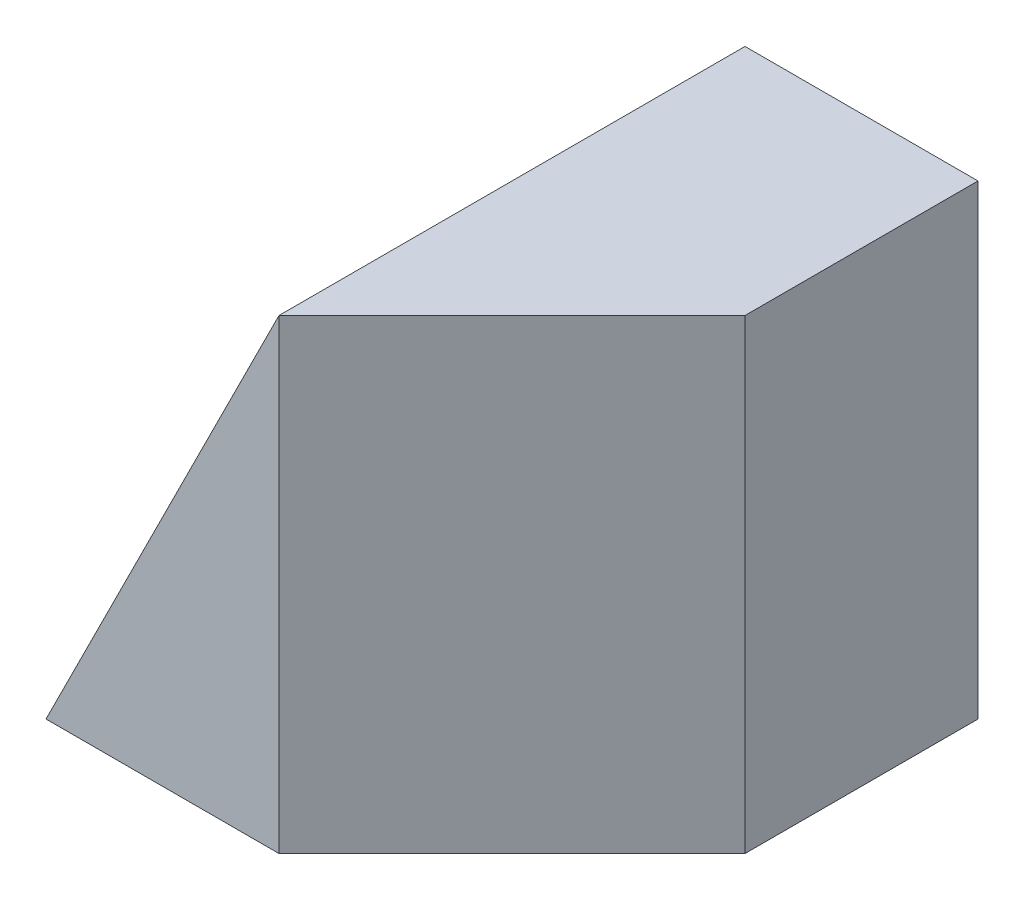
ISO-10303-21;
HEADER;
FILE_DESCRIPTION(('STEP AP214'),'2;1');
FILE_NAME('part.step','',(''),(''),'','','');
FILE_SCHEMA(('AUTOMOTIVE_DESIGN { 1 0 10303 214 1 1 1 1 }'));
ENDSEC;
DATA;
#1=APPLICATION_CONTEXT('core data for automotive mechanical design processes');
#2=APPLICATION_PROTOCOL_DEFINITION('international standard','automotive_design',2000,#1);
#3=PRODUCT_CONTEXT('',#1,'mechanical');
#4=PRODUCT('Part','Part','',(#3));
#5=PRODUCT_RELATED_PRODUCT_CATEGORY('part','',(#4));
#6=PRODUCT_DEFINITION_FORMATION('','',#4);
#7=PRODUCT_DEFINITION_CONTEXT('part definition',#1,'design');
#8=PRODUCT_DEFINITION('design','',#6,#7);
#9=PRODUCT_DEFINITION_SHAPE('','',#8);
#10=(LENGTH_UNIT() NAMED_UNIT(*) SI_UNIT(.MILLI.,.METRE.));
#11=(NAMED_UNIT(*) PLANE_ANGLE_UNIT() SI_UNIT($,.RADIAN.));
#12=(NAMED_UNIT(*) SI_UNIT($,.STERADIAN.) SOLID_ANGLE_UNIT());
#13=UNCERTAINTY_MEASURE_WITH_UNIT(LENGTH_MEASURE(1.E-05),#10,'distance_accuracy_value','');
#14=(GEOMETRIC_REPRESENTATION_CONTEXT(3) GLOBAL_UNCERTAINTY_ASSIGNED_CONTEXT((#13)) GLOBAL_UNIT_ASSIGNED_CONTEXT((#10,
#11,#12)) REPRESENTATION_CONTEXT('',''));
#15=CARTESIAN_POINT('',(0.,0.,0.));
#16=DIRECTION('',(0.,0.,1.));
#17=DIRECTION('',(1.,0.,0.));
#18=AXIS2_PLACEMENT_3D('',#15,#16,#17);
#19=CARTESIAN_POINT('',(0.,0.,40.));
#20=DIRECTION('',(0.,1.,0.));
#21=DIRECTION('',(0.,0.,1.));
#22=AXIS2_PLACEMENT_3D('',#19,#20,#21);
#23=PLANE('',#22);
#24=DIRECTION('',(0.,0.,-1.));
#25=VECTOR('',#24,1.);
#26=CARTESIAN_POINT('',(40.,0.,40.));
#27=LINE('',#26,#25);
#28=CARTESIAN_POINT('',(40.,0.,20.));
#29=VERTEX_POINT('',#28);
#30=CARTESIAN_POINT('',(40.,0.,0.));
#31=VERTEX_POINT('',#30);
#32=EDGE_CURVE('E40',#29,#31,#27,.T.);
#33=ORIENTED_EDGE('',*,*,#32,.F.);
#34=DIRECTION('',(-0.707106781186548,0.,0.707106781186548));
#35=VECTOR('',#34,1.);
#36=CARTESIAN_POINT('',(20.,0.,40.));
#37=LINE('',#36,#35);
#38=CARTESIAN_POINT('',(20.,0.,40.));
#39=VERTEX_POINT('',#38);
#40=EDGE_CURVE('E78',#29,#39,#37,.T.);
#41=ORIENTED_EDGE('',*,*,#40,.T.);
#42=DIRECTION('',(1.,0.,0.));
#43=VECTOR('',#42,1.);
#44=CARTESIAN_POINT('',(0.,0.,40.));
#45=LINE('',#44,#43);
#46=CARTESIAN_POINT('',(0.,0.,40.));
#47=VERTEX_POINT('',#46);
#48=EDGE_CURVE('E97',#47,#39,#45,.T.);
#49=ORIENTED_EDGE('',*,*,#48,.F.);
#50=DIRECTION('',(0.,0.,-1.));
#51=VECTOR('',#50,1.);
#52=CARTESIAN_POINT('',(0.,0.,40.));
#53=LINE('',#52,#51);
#54=CARTESIAN_POINT('',(0.,0.,0.));
#55=VERTEX_POINT('',#54);
#56=EDGE_CURVE('E11',#47,#55,#53,.T.);
#57=ORIENTED_EDGE('',*,*,#56,.T.);
#58=DIRECTION('',(1.,0.,0.));
#59=VECTOR('',#58,1.);
#60=CARTESIAN_POINT('',(0.,0.,0.));
#61=LINE('',#60,#59);
#62=EDGE_CURVE('E95',#55,#31,#61,.T.);
#63=ORIENTED_EDGE('',*,*,#62,.T.);
#64=EDGE_LOOP('',(#33,#41,#49,#57,#63));
#65=FACE_BOUND('',#64,.T.);
#66=ADVANCED_FACE('F33',(#65),#23,.F.);
#67=CARTESIAN_POINT('',(40.,0.,40.));
#68=DIRECTION('',(-1.,0.,0.));
#69=DIRECTION('',(0.,0.,1.));
#70=AXIS2_PLACEMENT_3D('',#67,#68,#69);
#71=PLANE('',#70);
#72=DIRECTION('',(0.,0.,-1.));
#73=VECTOR('',#72,1.);
#74=CARTESIAN_POINT('',(40.,40.,40.));
#75=LINE('',#74,#73);
#76=CARTESIAN_POINT('',(40.,40.,20.));
#77=VERTEX_POINT('',#76);
#78=CARTESIAN_POINT('',(40.,40.,0.));
#79=VERTEX_POINT('',#78);
#80=EDGE_CURVE('E55',#77,#79,#75,.T.);
#81=ORIENTED_EDGE('',*,*,#80,.F.);
#82=DIRECTION('',(0.,1.,0.));
#83=VECTOR('',#82,1.);
#84=CARTESIAN_POINT('',(40.,0.,20.));
#85=LINE('',#84,#83);
#86=EDGE_CURVE('E81',#29,#77,#85,.T.);
#87=ORIENTED_EDGE('',*,*,#86,.F.);
#88=ORIENTED_EDGE('',*,*,#32,.T.);
#89=DIRECTION('',(0.,1.,0.));
#90=VECTOR('',#89,1.);
#91=CARTESIAN_POINT('',(40.,0.,0.));
#92=LINE('',#91,#90);
#93=EDGE_CURVE('E102',#31,#79,#92,.T.);
#94=ORIENTED_EDGE('',*,*,#93,.T.);
#95=EDGE_LOOP('',(#81,#87,#88,#94));
#96=FACE_BOUND('',#95,.T.);
#97=ADVANCED_FACE('F91',(#96),#71,.F.);
#98=CARTESIAN_POINT('',(0.,40.,40.));
#99=DIRECTION('',(0.,-1.,0.));
#100=DIRECTION('',(0.,0.,-1.));
#101=AXIS2_PLACEMENT_3D('',#98,#99,#100);
#102=PLANE('',#101);
#103=DIRECTION('',(0.,0.,1.));
#104=VECTOR('',#103,1.);
#105=CARTESIAN_POINT('',(20.,40.,0.));
#106=LINE('',#105,#104);
#107=CARTESIAN_POINT('',(20.,40.,0.));
#108=VERTEX_POINT('',#107);
#109=CARTESIAN_POINT('',(20.,40.,40.));
#110=VERTEX_POINT('',#109);
#111=EDGE_CURVE('E47',#108,#110,#106,.T.);
#112=ORIENTED_EDGE('',*,*,#111,.T.);
#113=DIRECTION('',(-0.707106781186548,0.,0.707106781186548));
#114=VECTOR('',#113,1.);
#115=CARTESIAN_POINT('',(20.,40.,40.));
#116=LINE('',#115,#114);
#117=EDGE_CURVE('E88',#77,#110,#116,.T.);
#118=ORIENTED_EDGE('',*,*,#117,.F.);
#119=ORIENTED_EDGE('',*,*,#80,.T.);
#120=DIRECTION('',(-1.,0.,0.));
#121=VECTOR('',#120,1.);
#122=CARTESIAN_POINT('',(0.,40.,0.));
#123=LINE('',#122,#121);
#124=EDGE_CURVE('E100',#79,#108,#123,.T.);
#125=ORIENTED_EDGE('',*,*,#124,.T.);
#126=EDGE_LOOP('',(#112,#118,#119,#125));
#127=FACE_BOUND('',#126,.T.);
#128=ADVANCED_FACE('F116',(#127),#102,.F.);
#129=CARTESIAN_POINT('',(0.,0.,40.));
#130=DIRECTION('',(0.,0.,-1.));
#131=DIRECTION('',(-1.,0.,0.));
#132=AXIS2_PLACEMENT_3D('',#129,#130,#131);
#133=PLANE('',#132);
#134=ORIENTED_EDGE('',*,*,#48,.T.);
#135=DIRECTION('',(0.,1.,0.));
#136=VECTOR('',#135,1.);
#137=CARTESIAN_POINT('',(20.,0.,40.));
#138=LINE('',#137,#136);
#139=EDGE_CURVE('E83',#39,#110,#138,.T.);
#140=ORIENTED_EDGE('',*,*,#139,.T.);
#141=DIRECTION('',(0.447213595499958,0.894427190999916,0.));
#142=VECTOR('',#141,1.);
#143=CARTESIAN_POINT('',(0.,0.,40.));
#144=LINE('',#143,#142);
#145=EDGE_CURVE('E108',#47,#110,#144,.T.);
#146=ORIENTED_EDGE('',*,*,#145,.F.);
#147=EDGE_LOOP('',(#134,#140,#146));
#148=FACE_BOUND('',#147,.T.);
#149=ADVANCED_FACE('F114',(#148),#133,.F.);
#150=CARTESIAN_POINT('',(0.,0.,0.));
#151=DIRECTION('',(0.,0.,-1.));
#152=DIRECTION('',(-1.,0.,0.));
#153=AXIS2_PLACEMENT_3D('',#150,#151,#152);
#154=PLANE('',#153);
#155=DIRECTION('',(0.447213595499958,0.894427190999916,0.));
#156=VECTOR('',#155,1.);
#157=CARTESIAN_POINT('',(0.,0.,0.));
#158=LINE('',#157,#156);
#159=EDGE_CURVE('E107',#55,#108,#158,.T.);
#160=ORIENTED_EDGE('',*,*,#159,.T.);
#161=ORIENTED_EDGE('',*,*,#124,.F.);
#162=ORIENTED_EDGE('',*,*,#93,.F.);
#163=ORIENTED_EDGE('',*,*,#62,.F.);
#164=EDGE_LOOP('',(#160,#161,#162,#163));
#165=FACE_BOUND('',#164,.T.);
#166=ADVANCED_FACE('F119',(#165),#154,.T.);
#167=CARTESIAN_POINT('',(0.,0.,0.));
#168=DIRECTION('',(0.894427190999916,-0.447213595499958,0.));
#169=DIRECTION('',(0.447213595499958,0.894427190999916,0.));
#170=AXIS2_PLACEMENT_3D('',#167,#168,#169);
#171=PLANE('',#170);
#172=ORIENTED_EDGE('',*,*,#145,.T.);
#173=ORIENTED_EDGE('',*,*,#111,.F.);
#174=ORIENTED_EDGE('',*,*,#159,.F.);
#175=ORIENTED_EDGE('',*,*,#56,.F.);
#176=EDGE_LOOP('',(#172,#173,#174,#175));
#177=FACE_BOUND('',#176,.T.);
#178=ADVANCED_FACE('F115',(#177),#171,.F.);
#179=CARTESIAN_POINT('',(20.,0.,40.));
#180=DIRECTION('',(-0.707106781186548,0.,-0.707106781186548));
#181=DIRECTION('',(-0.707106781186548,0.,0.707106781186548));
#182=AXIS2_PLACEMENT_3D('',#179,#180,#181);
#183=PLANE('',#182);
#184=ORIENTED_EDGE('',*,*,#117,.T.);
#185=ORIENTED_EDGE('',*,*,#139,.F.);
#186=ORIENTED_EDGE('',*,*,#40,.F.);
#187=ORIENTED_EDGE('',*,*,#86,.T.);
#188=EDGE_LOOP('',(#184,#185,#186,#187));
#189=FACE_BOUND('',#188,.T.);
#190=ADVANCED_FACE('F80',(#189),#183,.F.);
#191=CLOSED_SHELL('',(#66,#97,#128,#149,#166,#178,#190));
#192=MANIFOLD_SOLID_BREP('B2',#191);
#193=ADVANCED_BREP_SHAPE_REPRESENTATION('',(#18,#192),#14);
#194=SHAPE_DEFINITION_REPRESENTATION(#9,#193);
ENDSEC;
END-ISO-10303-21;
